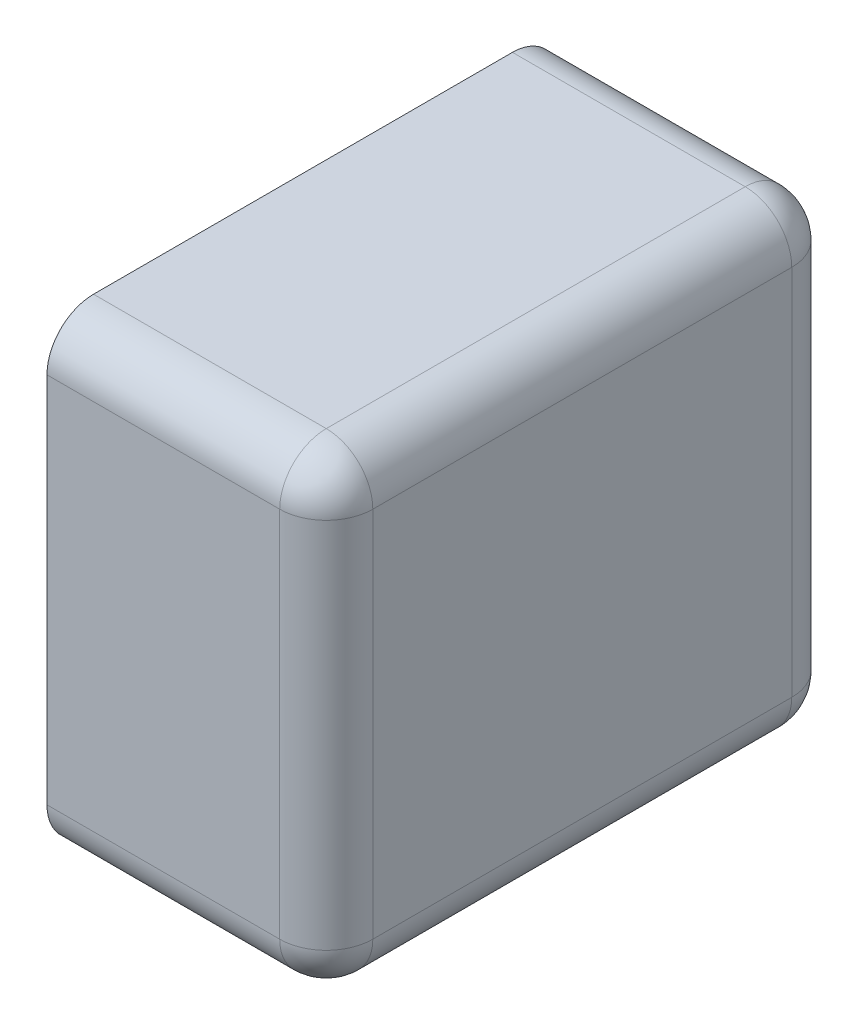
ISO-10303-21;
HEADER;
FILE_DESCRIPTION(('STEP AP214'),'2;1');
FILE_NAME('part.step','',(''),(''),'','','');
FILE_SCHEMA(('AUTOMOTIVE_DESIGN { 1 0 10303 214 1 1 1 1 }'));
ENDSEC;
DATA;
#1=APPLICATION_CONTEXT('core data for automotive mechanical design processes');
#2=APPLICATION_PROTOCOL_DEFINITION('international standard','automotive_design',2000,#1);
#3=PRODUCT_CONTEXT('',#1,'mechanical');
#4=PRODUCT('Part','Part','',(#3));
#5=PRODUCT_RELATED_PRODUCT_CATEGORY('part','',(#4));
#6=PRODUCT_DEFINITION_FORMATION('','',#4);
#7=PRODUCT_DEFINITION_CONTEXT('part definition',#1,'design');
#8=PRODUCT_DEFINITION('design','',#6,#7);
#9=PRODUCT_DEFINITION_SHAPE('','',#8);
#10=(LENGTH_UNIT() NAMED_UNIT(*) SI_UNIT(.MILLI.,.METRE.));
#11=(NAMED_UNIT(*) PLANE_ANGLE_UNIT() SI_UNIT($,.RADIAN.));
#12=(NAMED_UNIT(*) SI_UNIT($,.STERADIAN.) SOLID_ANGLE_UNIT());
#13=UNCERTAINTY_MEASURE_WITH_UNIT(LENGTH_MEASURE(1.E-05),#10,'distance_accuracy_value','');
#14=(GEOMETRIC_REPRESENTATION_CONTEXT(3) GLOBAL_UNCERTAINTY_ASSIGNED_CONTEXT((#13)) GLOBAL_UNIT_ASSIGNED_CONTEXT((#10,
#11,#12)) REPRESENTATION_CONTEXT('',''));
#15=CARTESIAN_POINT('',(0.,0.,0.));
#16=DIRECTION('',(0.,0.,1.));
#17=DIRECTION('',(1.,0.,0.));
#18=AXIS2_PLACEMENT_3D('',#15,#16,#17);
#19=CARTESIAN_POINT('',(0.5,0.25,0.));
#20=DIRECTION('',(-1.,0.,0.));
#21=DIRECTION('',(0.,0.,1.));
#22=AXIS2_PLACEMENT_3D('',#19,#20,#21);
#23=PLANE('',#22);
#24=DIRECTION('',(0.,0.,-1.));
#25=VECTOR('',#24,1.);
#26=CARTESIAN_POINT('',(0.5,-0.2,0.));
#27=LINE('',#26,#25);
#28=CARTESIAN_POINT('',(0.5,-0.2,0.05));
#29=VERTEX_POINT('',#28);
#30=CARTESIAN_POINT('',(0.5,-0.2,0.5));
#31=VERTEX_POINT('',#30);
#32=EDGE_CURVE('E96',#29,#31,#27,.F.);
#33=ORIENTED_EDGE('',*,*,#32,.F.);
#34=DIRECTION('',(0.,1.,0.));
#35=VECTOR('',#34,1.);
#36=CARTESIAN_POINT('',(0.5,0.125,0.05));
#37=LINE('',#36,#35);
#38=CARTESIAN_POINT('',(0.5,0.2,0.05));
#39=VERTEX_POINT('',#38);
#40=EDGE_CURVE('E117',#39,#29,#37,.F.);
#41=ORIENTED_EDGE('',*,*,#40,.F.);
#42=DIRECTION('',(0.,0.,-1.));
#43=VECTOR('',#42,1.);
#44=CARTESIAN_POINT('',(0.5,0.2,0.));
#45=LINE('',#44,#43);
#46=CARTESIAN_POINT('',(0.5,0.2,0.5));
#47=VERTEX_POINT('',#46);
#48=EDGE_CURVE('E338',#47,#39,#45,.T.);
#49=ORIENTED_EDGE('',*,*,#48,.F.);
#50=DIRECTION('',(0.,1.,0.));
#51=VECTOR('',#50,1.);
#52=CARTESIAN_POINT('',(0.5,0.125,0.5));
#53=LINE('',#52,#51);
#54=EDGE_CURVE('E349',#31,#47,#53,.T.);
#55=ORIENTED_EDGE('',*,*,#54,.F.);
#56=EDGE_LOOP('',(#33,#41,#49,#55));
#57=FACE_BOUND('',#56,.T.);
#58=ADVANCED_FACE('F17',(#57),#23,.F.);
#59=CARTESIAN_POINT('',(0.45,-0.2,0.));
#60=DIRECTION('',(0.,0.,-1.));
#61=DIRECTION('',(-1.,0.,0.));
#62=AXIS2_PLACEMENT_3D('',#59,#60,#61);
#63=CYLINDRICAL_SURFACE('',#62,0.05);
#64=CARTESIAN_POINT('',(0.45,-0.2,0.5));
#65=DIRECTION('',(0.,0.,-1.));
#66=DIRECTION('',(-1.,0.,0.));
#67=AXIS2_PLACEMENT_3D('',#64,#65,#66);
#68=CIRCLE('',#67,0.05);
#69=CARTESIAN_POINT('',(0.45,-0.25,0.5));
#70=VERTEX_POINT('',#69);
#71=EDGE_CURVE('E129',#70,#31,#68,.F.);
#72=ORIENTED_EDGE('',*,*,#71,.F.);
#73=DIRECTION('',(0.,0.,1.));
#74=VECTOR('',#73,1.);
#75=CARTESIAN_POINT('',(0.45,-0.25,0.));
#76=LINE('',#75,#74);
#77=CARTESIAN_POINT('',(0.45,-0.25,0.05));
#78=VERTEX_POINT('',#77);
#79=EDGE_CURVE('E125',#70,#78,#76,.F.);
#80=ORIENTED_EDGE('',*,*,#79,.T.);
#81=CARTESIAN_POINT('',(0.45,-0.2,0.05));
#82=DIRECTION('',(0.,0.,-1.));
#83=DIRECTION('',(-1.,0.,0.));
#84=AXIS2_PLACEMENT_3D('',#81,#82,#83);
#85=CIRCLE('',#84,0.05);
#86=EDGE_CURVE('E20',#29,#78,#85,.T.);
#87=ORIENTED_EDGE('',*,*,#86,.F.);
#88=ORIENTED_EDGE('',*,*,#32,.T.);
#89=EDGE_LOOP('',(#72,#80,#87,#88));
#90=FACE_BOUND('',#89,.T.);
#91=ADVANCED_FACE('F105',(#90),#63,.T.);
#92=CARTESIAN_POINT('',(0.45,-0.2,0.05));
#93=DIRECTION('',(0.577350269189626,-0.577350269189626,-0.577350269189626));
#94=DIRECTION('',(-0.707106781186548,-0.707106781186548,0.));
#95=AXIS2_PLACEMENT_3D('',#92,#93,#94);
#96=SPHERICAL_SURFACE('',#95,0.05);
#97=CARTESIAN_POINT('',(0.478867513459481,-0.228867513459481,0.0211324865405187));
#98=VERTEX_POINT('',#97);
#99=VERTEX_LOOP('',#98);
#100=FACE_BOUND('',#99,.T.);
#101=ORIENTED_EDGE('',*,*,#86,.T.);
#102=CARTESIAN_POINT('',(0.45,-0.2,0.05));
#103=DIRECTION('',(1.,0.,0.));
#104=DIRECTION('',(0.,0.,-1.));
#105=AXIS2_PLACEMENT_3D('',#102,#103,#104);
#106=CIRCLE('',#105,0.05);
#107=CARTESIAN_POINT('',(0.45,-0.2,0.));
#108=VERTEX_POINT('',#107);
#109=EDGE_CURVE('E112',#108,#78,#106,.F.);
#110=ORIENTED_EDGE('',*,*,#109,.F.);
#111=CARTESIAN_POINT('',(0.45,-0.2,0.05));
#112=DIRECTION('',(0.,1.,0.));
#113=DIRECTION('',(0.,0.,1.));
#114=AXIS2_PLACEMENT_3D('',#111,#112,#113);
#115=CIRCLE('',#114,0.05);
#116=EDGE_CURVE('E114',#29,#108,#115,.T.);
#117=ORIENTED_EDGE('',*,*,#116,.F.);
#118=EDGE_LOOP('',(#101,#110,#117));
#119=FACE_BOUND('',#118,.T.);
#120=ADVANCED_FACE('F101',(#100,#119),#96,.T.);
#121=CARTESIAN_POINT('',(0.45,0.125,0.05));
#122=DIRECTION('',(0.,1.,0.));
#123=DIRECTION('',(0.,0.,1.));
#124=AXIS2_PLACEMENT_3D('',#121,#122,#123);
#125=CYLINDRICAL_SURFACE('',#124,0.05);
#126=ORIENTED_EDGE('',*,*,#116,.T.);
#127=DIRECTION('',(0.,1.,0.));
#128=VECTOR('',#127,1.);
#129=CARTESIAN_POINT('',(0.45,0.,0.));
#130=LINE('',#129,#128);
#131=CARTESIAN_POINT('',(0.45,0.2,0.));
#132=VERTEX_POINT('',#131);
#133=EDGE_CURVE('E138',#132,#108,#130,.F.);
#134=ORIENTED_EDGE('',*,*,#133,.F.);
#135=CARTESIAN_POINT('',(0.45,0.2,0.05));
#136=DIRECTION('',(0.,1.,0.));
#137=DIRECTION('',(0.,0.,1.));
#138=AXIS2_PLACEMENT_3D('',#135,#136,#137);
#139=CIRCLE('',#138,0.05);
#140=EDGE_CURVE('E358',#39,#132,#139,.T.);
#141=ORIENTED_EDGE('',*,*,#140,.F.);
#142=ORIENTED_EDGE('',*,*,#40,.T.);
#143=EDGE_LOOP('',(#126,#134,#141,#142));
#144=FACE_BOUND('',#143,.T.);
#145=ADVANCED_FACE('F104',(#144),#125,.T.);
#146=CARTESIAN_POINT('',(0.45,0.2,0.05));
#147=DIRECTION('',(0.577350269189626,0.577350269189626,-0.577350269189626));
#148=DIRECTION('',(0.707106781186548,-0.707106781186548,0.));
#149=AXIS2_PLACEMENT_3D('',#146,#147,#148);
#150=SPHERICAL_SURFACE('',#149,0.05);
#151=CARTESIAN_POINT('',(0.478867513459481,0.228867513459481,0.0211324865405187));
#152=VERTEX_POINT('',#151);
#153=VERTEX_LOOP('',#152);
#154=FACE_BOUND('',#153,.T.);
#155=ORIENTED_EDGE('',*,*,#140,.T.);
#156=CARTESIAN_POINT('',(0.45,0.2,0.05));
#157=DIRECTION('',(-1.,0.,0.));
#158=DIRECTION('',(0.,0.,1.));
#159=AXIS2_PLACEMENT_3D('',#156,#157,#158);
#160=CIRCLE('',#159,0.05);
#161=CARTESIAN_POINT('',(0.45,0.25,0.05));
#162=VERTEX_POINT('',#161);
#163=EDGE_CURVE('E378',#162,#132,#160,.T.);
#164=ORIENTED_EDGE('',*,*,#163,.F.);
#165=CARTESIAN_POINT('',(0.45,0.2,0.05));
#166=DIRECTION('',(0.,0.,-1.));
#167=DIRECTION('',(-1.,0.,0.));
#168=AXIS2_PLACEMENT_3D('',#165,#166,#167);
#169=CIRCLE('',#168,0.05);
#170=EDGE_CURVE('E356',#39,#162,#169,.F.);
#171=ORIENTED_EDGE('',*,*,#170,.F.);
#172=EDGE_LOOP('',(#155,#164,#171));
#173=FACE_BOUND('',#172,.T.);
#174=ADVANCED_FACE('F177',(#154,#173),#150,.T.);
#175=CARTESIAN_POINT('',(0.45,0.2,0.));
#176=DIRECTION('',(0.,0.,-1.));
#177=DIRECTION('',(-1.,0.,0.));
#178=AXIS2_PLACEMENT_3D('',#175,#176,#177);
#179=CYLINDRICAL_SURFACE('',#178,0.05);
#180=CARTESIAN_POINT('',(0.45,0.2,0.5));
#181=DIRECTION('',(0.,0.,-1.));
#182=DIRECTION('',(-1.,0.,0.));
#183=AXIS2_PLACEMENT_3D('',#180,#181,#182);
#184=CIRCLE('',#183,0.05);
#185=CARTESIAN_POINT('',(0.45,0.25,0.5));
#186=VERTEX_POINT('',#185);
#187=EDGE_CURVE('E336',#47,#186,#184,.F.);
#188=ORIENTED_EDGE('',*,*,#187,.F.);
#189=ORIENTED_EDGE('',*,*,#48,.T.);
#190=ORIENTED_EDGE('',*,*,#170,.T.);
#191=DIRECTION('',(0.,0.,-1.));
#192=VECTOR('',#191,1.);
#193=CARTESIAN_POINT('',(0.45,0.25,0.));
#194=LINE('',#193,#192);
#195=EDGE_CURVE('E152',#162,#186,#194,.F.);
#196=ORIENTED_EDGE('',*,*,#195,.T.);
#197=EDGE_LOOP('',(#188,#189,#190,#196));
#198=FACE_BOUND('',#197,.T.);
#199=ADVANCED_FACE('F168',(#198),#179,.T.);
#200=CARTESIAN_POINT('',(0.45,0.2,0.5));
#201=DIRECTION('',(0.577350269189626,0.577350269189626,0.577350269189626));
#202=DIRECTION('',(-0.707106781186548,0.,0.707106781186548));
#203=AXIS2_PLACEMENT_3D('',#200,#201,#202);
#204=SPHERICAL_SURFACE('',#203,0.05);
#205=CARTESIAN_POINT('',(0.478867513459481,0.228867513459481,0.528867513459481));
#206=VERTEX_POINT('',#205);
#207=VERTEX_LOOP('',#206);
#208=FACE_BOUND('',#207,.T.);
#209=ORIENTED_EDGE('',*,*,#187,.T.);
#210=CARTESIAN_POINT('',(0.45,0.2,0.5));
#211=DIRECTION('',(-1.,0.,0.));
#212=DIRECTION('',(0.,0.,1.));
#213=AXIS2_PLACEMENT_3D('',#210,#211,#212);
#214=CIRCLE('',#213,0.05);
#215=CARTESIAN_POINT('',(0.45,0.2,0.55));
#216=VERTEX_POINT('',#215);
#217=EDGE_CURVE('E350',#216,#186,#214,.T.);
#218=ORIENTED_EDGE('',*,*,#217,.F.);
#219=CARTESIAN_POINT('',(0.45,0.2,0.5));
#220=DIRECTION('',(0.,1.,0.));
#221=DIRECTION('',(0.,0.,1.));
#222=AXIS2_PLACEMENT_3D('',#219,#220,#221);
#223=CIRCLE('',#222,0.05);
#224=EDGE_CURVE('E346',#47,#216,#223,.F.);
#225=ORIENTED_EDGE('',*,*,#224,.F.);
#226=EDGE_LOOP('',(#209,#218,#225));
#227=FACE_BOUND('',#226,.T.);
#228=ADVANCED_FACE('F164',(#208,#227),#204,.T.);
#229=CARTESIAN_POINT('',(0.45,0.125,0.5));
#230=DIRECTION('',(0.,1.,0.));
#231=DIRECTION('',(0.,0.,1.));
#232=AXIS2_PLACEMENT_3D('',#229,#230,#231);
#233=CYLINDRICAL_SURFACE('',#232,0.05);
#234=CARTESIAN_POINT('',(0.45,-0.2,0.5));
#235=DIRECTION('',(0.,1.,0.));
#236=DIRECTION('',(0.,0.,1.));
#237=AXIS2_PLACEMENT_3D('',#234,#235,#236);
#238=CIRCLE('',#237,0.05);
#239=CARTESIAN_POINT('',(0.45,-0.2,0.55));
#240=VERTEX_POINT('',#239);
#241=EDGE_CURVE('E133',#31,#240,#238,.F.);
#242=ORIENTED_EDGE('',*,*,#241,.F.);
#243=ORIENTED_EDGE('',*,*,#54,.T.);
#244=ORIENTED_EDGE('',*,*,#224,.T.);
#245=DIRECTION('',(0.,1.,0.));
#246=VECTOR('',#245,1.);
#247=CARTESIAN_POINT('',(0.45,0.,0.55));
#248=LINE('',#247,#246);
#249=EDGE_CURVE('E145',#216,#240,#248,.F.);
#250=ORIENTED_EDGE('',*,*,#249,.T.);
#251=EDGE_LOOP('',(#242,#243,#244,#250));
#252=FACE_BOUND('',#251,.T.);
#253=ADVANCED_FACE('F159',(#252),#233,.T.);
#254=CARTESIAN_POINT('',(0.45,-0.2,0.5));
#255=DIRECTION('',(0.577350269189626,-0.577350269189626,0.577350269189626));
#256=DIRECTION('',(-0.707106781186548,0.,0.707106781186548));
#257=AXIS2_PLACEMENT_3D('',#254,#255,#256);
#258=SPHERICAL_SURFACE('',#257,0.05);
#259=CARTESIAN_POINT('',(0.478867513459481,-0.228867513459481,0.528867513459481));
#260=VERTEX_POINT('',#259);
#261=VERTEX_LOOP('',#260);
#262=FACE_BOUND('',#261,.T.);
#263=ORIENTED_EDGE('',*,*,#241,.T.);
#264=CARTESIAN_POINT('',(0.45,-0.2,0.5));
#265=DIRECTION('',(1.,0.,0.));
#266=DIRECTION('',(0.,0.,-1.));
#267=AXIS2_PLACEMENT_3D('',#264,#265,#266);
#268=CIRCLE('',#267,0.05);
#269=EDGE_CURVE('E148',#70,#240,#268,.F.);
#270=ORIENTED_EDGE('',*,*,#269,.F.);
#271=ORIENTED_EDGE('',*,*,#71,.T.);
#272=EDGE_LOOP('',(#263,#270,#271));
#273=FACE_BOUND('',#272,.T.);
#274=ADVANCED_FACE('F155',(#262,#273),#258,.T.);
#275=CARTESIAN_POINT('',(0.5,-0.25,0.));
#276=DIRECTION('',(0.,1.,0.));
#277=DIRECTION('',(0.,0.,1.));
#278=AXIS2_PLACEMENT_3D('',#275,#276,#277);
#279=PLANE('',#278);
#280=DIRECTION('',(1.,0.,0.));
#281=VECTOR('',#280,1.);
#282=CARTESIAN_POINT('',(0.425,-0.25,0.5));
#283=LINE('',#282,#281);
#284=CARTESIAN_POINT('',(0.2,-0.25,0.5));
#285=VERTEX_POINT('',#284);
#286=EDGE_CURVE('E383',#285,#70,#283,.T.);
#287=ORIENTED_EDGE('',*,*,#286,.F.);
#288=DIRECTION('',(0.,0.,-1.));
#289=VECTOR('',#288,1.);
#290=CARTESIAN_POINT('',(0.2,-0.25,0.));
#291=LINE('',#290,#289);
#292=CARTESIAN_POINT('',(0.2,-0.25,0.05));
#293=VERTEX_POINT('',#292);
#294=EDGE_CURVE('E137',#285,#293,#291,.T.);
#295=ORIENTED_EDGE('',*,*,#294,.T.);
#296=DIRECTION('',(1.,0.,0.));
#297=VECTOR('',#296,1.);
#298=CARTESIAN_POINT('',(0.425,-0.25,0.05));
#299=LINE('',#298,#297);
#300=EDGE_CURVE('E122',#78,#293,#299,.F.);
#301=ORIENTED_EDGE('',*,*,#300,.F.);
#302=ORIENTED_EDGE('',*,*,#79,.F.);
#303=EDGE_LOOP('',(#287,#295,#301,#302));
#304=FACE_BOUND('',#303,.T.);
#305=ADVANCED_FACE('F136',(#304),#279,.F.);
#306=CARTESIAN_POINT('',(0.425,-0.2,0.05));
#307=DIRECTION('',(1.,0.,0.));
#308=DIRECTION('',(0.,0.,-1.));
#309=AXIS2_PLACEMENT_3D('',#306,#307,#308);
#310=CYLINDRICAL_SURFACE('',#309,0.05);
#311=CARTESIAN_POINT('',(0.2,-0.2,0.05));
#312=DIRECTION('',(1.,0.,0.));
#313=DIRECTION('',(0.,0.,-1.));
#314=AXIS2_PLACEMENT_3D('',#311,#312,#313);
#315=CIRCLE('',#314,0.05);
#316=CARTESIAN_POINT('',(0.2,-0.2,0.));
#317=VERTEX_POINT('',#316);
#318=EDGE_CURVE('E373',#293,#317,#315,.T.);
#319=ORIENTED_EDGE('',*,*,#318,.T.);
#320=DIRECTION('',(-1.,0.,0.));
#321=VECTOR('',#320,1.);
#322=CARTESIAN_POINT('',(0.35,-0.2,0.));
#323=LINE('',#322,#321);
#324=EDGE_CURVE('E124',#108,#317,#323,.T.);
#325=ORIENTED_EDGE('',*,*,#324,.F.);
#326=ORIENTED_EDGE('',*,*,#109,.T.);
#327=ORIENTED_EDGE('',*,*,#300,.T.);
#328=EDGE_LOOP('',(#319,#325,#326,#327));
#329=FACE_BOUND('',#328,.T.);
#330=ADVANCED_FACE('F120',(#329),#310,.T.);
#331=CARTESIAN_POINT('',(0.35,0.,0.));
#332=DIRECTION('',(0.,0.,-1.));
#333=DIRECTION('',(-1.,0.,0.));
#334=AXIS2_PLACEMENT_3D('',#331,#332,#333);
#335=PLANE('',#334);
#336=DIRECTION('',(0.,1.,0.));
#337=VECTOR('',#336,1.);
#338=CARTESIAN_POINT('',(0.2,-0.25,0.));
#339=LINE('',#338,#337);
#340=CARTESIAN_POINT('',(0.2,0.2,0.));
#341=VERTEX_POINT('',#340);
#342=EDGE_CURVE('E372',#317,#341,#339,.T.);
#343=ORIENTED_EDGE('',*,*,#342,.T.);
#344=DIRECTION('',(-1.,0.,0.));
#345=VECTOR('',#344,1.);
#346=CARTESIAN_POINT('',(0.275,0.2,0.));
#347=LINE('',#346,#345);
#348=EDGE_CURVE('E380',#132,#341,#347,.T.);
#349=ORIENTED_EDGE('',*,*,#348,.F.);
#350=ORIENTED_EDGE('',*,*,#133,.T.);
#351=ORIENTED_EDGE('',*,*,#324,.T.);
#352=EDGE_LOOP('',(#343,#349,#350,#351));
#353=FACE_BOUND('',#352,.T.);
#354=ADVANCED_FACE('F214',(#353),#335,.T.);
#355=CARTESIAN_POINT('',(0.275,0.2,0.05));
#356=DIRECTION('',(-1.,0.,0.));
#357=DIRECTION('',(0.,0.,1.));
#358=AXIS2_PLACEMENT_3D('',#355,#356,#357);
#359=CYLINDRICAL_SURFACE('',#358,0.05);
#360=CARTESIAN_POINT('',(0.2,0.2,0.05));
#361=DIRECTION('',(-1.,0.,0.));
#362=DIRECTION('',(0.,0.,1.));
#363=AXIS2_PLACEMENT_3D('',#360,#361,#362);
#364=CIRCLE('',#363,0.05);
#365=CARTESIAN_POINT('',(0.2,0.25,0.05));
#366=VERTEX_POINT('',#365);
#367=EDGE_CURVE('E369',#341,#366,#364,.F.);
#368=ORIENTED_EDGE('',*,*,#367,.T.);
#369=DIRECTION('',(1.,0.,0.));
#370=VECTOR('',#369,1.);
#371=CARTESIAN_POINT('',(0.2,0.25,0.05));
#372=LINE('',#371,#370);
#373=EDGE_CURVE('E393',#366,#162,#372,.T.);
#374=ORIENTED_EDGE('',*,*,#373,.T.);
#375=ORIENTED_EDGE('',*,*,#163,.T.);
#376=ORIENTED_EDGE('',*,*,#348,.T.);
#377=EDGE_LOOP('',(#368,#374,#375,#376));
#378=FACE_BOUND('',#377,.T.);
#379=ADVANCED_FACE('F210',(#378),#359,.T.);
#380=CARTESIAN_POINT('',(0.2,0.25,0.));
#381=DIRECTION('',(0.,-1.,0.));
#382=DIRECTION('',(0.,0.,-1.));
#383=AXIS2_PLACEMENT_3D('',#380,#381,#382);
#384=PLANE('',#383);
#385=ORIENTED_EDGE('',*,*,#373,.F.);
#386=DIRECTION('',(0.,0.,-1.));
#387=VECTOR('',#386,1.);
#388=CARTESIAN_POINT('',(0.2,0.25,0.));
#389=LINE('',#388,#387);
#390=CARTESIAN_POINT('',(0.2,0.25,0.5));
#391=VERTEX_POINT('',#390);
#392=EDGE_CURVE('E368',#366,#391,#389,.F.);
#393=ORIENTED_EDGE('',*,*,#392,.T.);
#394=DIRECTION('',(-1.,0.,0.));
#395=VECTOR('',#394,1.);
#396=CARTESIAN_POINT('',(0.275,0.25,0.5));
#397=LINE('',#396,#395);
#398=EDGE_CURVE('E377',#186,#391,#397,.T.);
#399=ORIENTED_EDGE('',*,*,#398,.F.);
#400=ORIENTED_EDGE('',*,*,#195,.F.);
#401=EDGE_LOOP('',(#385,#393,#399,#400));
#402=FACE_BOUND('',#401,.T.);
#403=ADVANCED_FACE('F206',(#402),#384,.F.);
#404=CARTESIAN_POINT('',(0.275,0.2,0.5));
#405=DIRECTION('',(-1.,0.,0.));
#406=DIRECTION('',(0.,0.,1.));
#407=AXIS2_PLACEMENT_3D('',#404,#405,#406);
#408=CYLINDRICAL_SURFACE('',#407,0.05);
#409=CARTESIAN_POINT('',(0.2,0.2,0.5));
#410=DIRECTION('',(-1.,0.,0.));
#411=DIRECTION('',(0.,0.,1.));
#412=AXIS2_PLACEMENT_3D('',#409,#410,#411);
#413=CIRCLE('',#412,0.05);
#414=CARTESIAN_POINT('',(0.2,0.2,0.55));
#415=VERTEX_POINT('',#414);
#416=EDGE_CURVE('E365',#391,#415,#413,.F.);
#417=ORIENTED_EDGE('',*,*,#416,.T.);
#418=DIRECTION('',(-1.,0.,0.));
#419=VECTOR('',#418,1.);
#420=CARTESIAN_POINT('',(0.35,0.2,0.55));
#421=LINE('',#420,#419);
#422=EDGE_CURVE('E149',#415,#216,#421,.F.);
#423=ORIENTED_EDGE('',*,*,#422,.T.);
#424=ORIENTED_EDGE('',*,*,#217,.T.);
#425=ORIENTED_EDGE('',*,*,#398,.T.);
#426=EDGE_LOOP('',(#417,#423,#424,#425));
#427=FACE_BOUND('',#426,.T.);
#428=ADVANCED_FACE('F202',(#427),#408,.T.);
#429=CARTESIAN_POINT('',(0.35,0.,0.55));
#430=DIRECTION('',(0.,0.,-1.));
#431=DIRECTION('',(-1.,0.,0.));
#432=AXIS2_PLACEMENT_3D('',#429,#430,#431);
#433=PLANE('',#432);
#434=ORIENTED_EDGE('',*,*,#422,.F.);
#435=DIRECTION('',(0.,1.,0.));
#436=VECTOR('',#435,1.);
#437=CARTESIAN_POINT('',(0.2,-0.25,0.55));
#438=LINE('',#437,#436);
#439=CARTESIAN_POINT('',(0.2,-0.2,0.55));
#440=VERTEX_POINT('',#439);
#441=EDGE_CURVE('E26',#415,#440,#438,.F.);
#442=ORIENTED_EDGE('',*,*,#441,.T.);
#443=DIRECTION('',(1.,0.,0.));
#444=VECTOR('',#443,1.);
#445=CARTESIAN_POINT('',(0.425,-0.2,0.55));
#446=LINE('',#445,#444);
#447=EDGE_CURVE('E34',#240,#440,#446,.F.);
#448=ORIENTED_EDGE('',*,*,#447,.F.);
#449=ORIENTED_EDGE('',*,*,#249,.F.);
#450=EDGE_LOOP('',(#434,#442,#448,#449));
#451=FACE_BOUND('',#450,.T.);
#452=ADVANCED_FACE('F196',(#451),#433,.F.);
#453=CARTESIAN_POINT('',(0.425,-0.2,0.5));
#454=DIRECTION('',(1.,0.,0.));
#455=DIRECTION('',(0.,0.,-1.));
#456=AXIS2_PLACEMENT_3D('',#453,#454,#455);
#457=CYLINDRICAL_SURFACE('',#456,0.05);
#458=CARTESIAN_POINT('',(0.2,-0.2,0.5));
#459=DIRECTION('',(1.,0.,0.));
#460=DIRECTION('',(0.,0.,-1.));
#461=AXIS2_PLACEMENT_3D('',#458,#459,#460);
#462=CIRCLE('',#461,0.05);
#463=EDGE_CURVE('E11',#440,#285,#462,.T.);
#464=ORIENTED_EDGE('',*,*,#463,.T.);
#465=ORIENTED_EDGE('',*,*,#286,.T.);
#466=ORIENTED_EDGE('',*,*,#269,.T.);
#467=ORIENTED_EDGE('',*,*,#447,.T.);
#468=EDGE_LOOP('',(#464,#465,#466,#467));
#469=FACE_BOUND('',#468,.T.);
#470=ADVANCED_FACE('F190',(#469),#457,.T.);
#471=CARTESIAN_POINT('',(0.2,-0.25,0.));
#472=DIRECTION('',(1.,0.,0.));
#473=DIRECTION('',(0.,0.,-1.));
#474=AXIS2_PLACEMENT_3D('',#471,#472,#473);
#475=PLANE('',#474);
#476=ORIENTED_EDGE('',*,*,#441,.F.);
#477=ORIENTED_EDGE('',*,*,#416,.F.);
#478=ORIENTED_EDGE('',*,*,#392,.F.);
#479=ORIENTED_EDGE('',*,*,#367,.F.);
#480=ORIENTED_EDGE('',*,*,#342,.F.);
#481=ORIENTED_EDGE('',*,*,#318,.F.);
#482=ORIENTED_EDGE('',*,*,#294,.F.);
#483=ORIENTED_EDGE('',*,*,#463,.F.);
#484=EDGE_LOOP('',(#476,#477,#478,#479,#480,#481,#482,#483));
#485=FACE_BOUND('',#484,.T.);
#486=ADVANCED_FACE('F188',(#485),#475,.F.);
#487=CLOSED_SHELL('',(#58,#91,#120,#145,#174,#199,#228,#253,#274,#305,#330,#354,#379,#403,#428,
#452,#470,#486));
#488=MANIFOLD_SOLID_BREP('B1',#487);
#489=ADVANCED_BREP_SHAPE_REPRESENTATION('',(#18,#488),#14);
#490=SHAPE_DEFINITION_REPRESENTATION(#9,#489);
ENDSEC;
END-ISO-10303-21;
